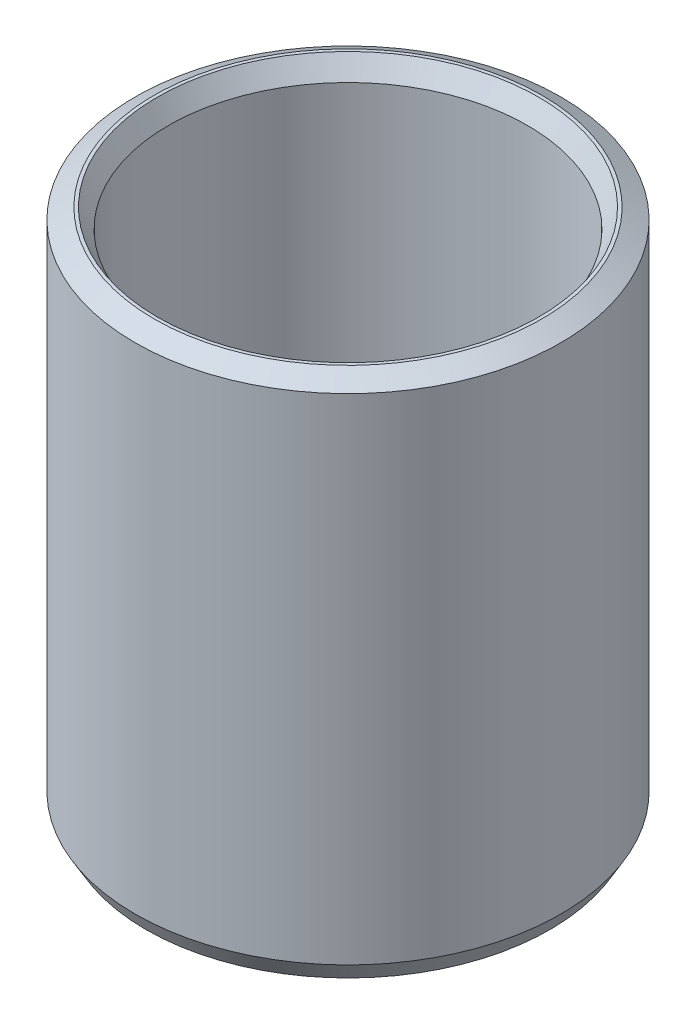
ISO-10303-21;
HEADER;
FILE_DESCRIPTION(('STEP AP214'),'2;1');
FILE_NAME('part.step','',(''),(''),'','','');
FILE_SCHEMA(('AUTOMOTIVE_DESIGN { 1 0 10303 214 1 1 1 1 }'));
ENDSEC;
DATA;
#1=APPLICATION_CONTEXT('core data for automotive mechanical design processes');
#2=APPLICATION_PROTOCOL_DEFINITION('international standard','automotive_design',2000,#1);
#3=PRODUCT_CONTEXT('',#1,'mechanical');
#4=PRODUCT('Part','Part','',(#3));
#5=PRODUCT_RELATED_PRODUCT_CATEGORY('part','',(#4));
#6=PRODUCT_DEFINITION_FORMATION('','',#4);
#7=PRODUCT_DEFINITION_CONTEXT('part definition',#1,'design');
#8=PRODUCT_DEFINITION('design','',#6,#7);
#9=PRODUCT_DEFINITION_SHAPE('','',#8);
#10=(LENGTH_UNIT() NAMED_UNIT(*) SI_UNIT(.MILLI.,.METRE.));
#11=(NAMED_UNIT(*) PLANE_ANGLE_UNIT() SI_UNIT($,.RADIAN.));
#12=(NAMED_UNIT(*) SI_UNIT($,.STERADIAN.) SOLID_ANGLE_UNIT());
#13=UNCERTAINTY_MEASURE_WITH_UNIT(LENGTH_MEASURE(1.E-05),#10,'distance_accuracy_value','');
#14=(GEOMETRIC_REPRESENTATION_CONTEXT(3) GLOBAL_UNCERTAINTY_ASSIGNED_CONTEXT((#13)) GLOBAL_UNIT_ASSIGNED_CONTEXT((#10,
#11,#12)) REPRESENTATION_CONTEXT('',''));
#15=CARTESIAN_POINT('',(0.,0.,0.));
#16=DIRECTION('',(0.,0.,1.));
#17=DIRECTION('',(1.,0.,0.));
#18=AXIS2_PLACEMENT_3D('',#15,#16,#17);
#19=CARTESIAN_POINT('',(0.,92.4407219834639,0.));
#20=DIRECTION('',(0.,-1.,0.));
#21=DIRECTION('',(0.,0.,-1.));
#22=AXIS2_PLACEMENT_3D('',#19,#20,#21);
#23=CYLINDRICAL_SURFACE('',#22,37.5);
#24=CARTESIAN_POINT('',(0.,3.36107461421821,0.));
#25=DIRECTION('',(0.,1.,0.));
#26=DIRECTION('',(0.,0.,1.));
#27=AXIS2_PLACEMENT_3D('',#24,#25,#26);
#28=CIRCLE('',#27,37.5);
#29=CARTESIAN_POINT('',(0.,3.36107461421821,37.5));
#30=VERTEX_POINT('',#29);
#31=EDGE_CURVE('E10',#30,#30,#28,.T.);
#32=ORIENTED_EDGE('',*,*,#31,.T.);
#33=EDGE_LOOP('',(#32));
#34=FACE_BOUND('',#33,.T.);
#35=CARTESIAN_POINT('',(0.,90.5002046501786,0.));
#36=DIRECTION('',(0.,1.,0.));
#37=DIRECTION('',(0.,0.,1.));
#38=AXIS2_PLACEMENT_3D('',#35,#36,#37);
#39=CIRCLE('',#38,37.5);
#40=CARTESIAN_POINT('',(0.,90.5002046501786,37.5));
#41=VERTEX_POINT('',#40);
#42=EDGE_CURVE('E50',#41,#41,#39,.F.);
#43=ORIENTED_EDGE('',*,*,#42,.T.);
#44=EDGE_LOOP('',(#43));
#45=FACE_BOUND('',#44,.T.);
#46=ADVANCED_FACE('F39',(#34,#45),#23,.T.);
#47=CARTESIAN_POINT('',(0.,92.4407219834639,0.));
#48=DIRECTION('',(0.,1.,0.));
#49=DIRECTION('',(0.,0.,1.));
#50=AXIS2_PLACEMENT_3D('',#47,#48,#49);
#51=PLANE('',#50);
#52=CARTESIAN_POINT('',(0.,92.4407219834639,0.));
#53=DIRECTION('',(0.,1.,0.));
#54=DIRECTION('',(0.,0.,1.));
#55=AXIS2_PLACEMENT_3D('',#52,#53,#54);
#56=CIRCLE('',#55,33.5708104720832);
#57=CARTESIAN_POINT('',(0.,92.4407219834639,33.5708104720832));
#58=VERTEX_POINT('',#57);
#59=EDGE_CURVE('E58',#58,#58,#56,.F.);
#60=ORIENTED_EDGE('',*,*,#59,.T.);
#61=EDGE_LOOP('',(#60));
#62=FACE_BOUND('',#61,.T.);
#63=CARTESIAN_POINT('',(0.,92.4407219834639,0.));
#64=DIRECTION('',(0.,1.,0.));
#65=DIRECTION('',(0.,0.,1.));
#66=AXIS2_PLACEMENT_3D('',#63,#64,#65);
#67=CIRCLE('',#66,34.1389253857818);
#68=CARTESIAN_POINT('',(0.,92.4407219834639,34.1389253857818));
#69=VERTEX_POINT('',#68);
#70=EDGE_CURVE('E61',#69,#69,#67,.T.);
#71=ORIENTED_EDGE('',*,*,#70,.T.);
#72=EDGE_LOOP('',(#71));
#73=FACE_BOUND('',#72,.T.);
#74=ADVANCED_FACE('F88',(#62,#73),#51,.T.);
#75=CARTESIAN_POINT('',(0.,0.,0.));
#76=DIRECTION('',(0.,1.,0.));
#77=DIRECTION('',(0.,0.,1.));
#78=AXIS2_PLACEMENT_3D('',#75,#76,#77);
#79=PLANE('',#78);
#80=CARTESIAN_POINT('',(0.,0.,0.));
#81=DIRECTION('',(0.,1.,0.));
#82=DIRECTION('',(0.,0.,1.));
#83=AXIS2_PLACEMENT_3D('',#80,#81,#82);
#84=CIRCLE('',#83,34.991367753016);
#85=CARTESIAN_POINT('',(0.,0.,34.991367753016));
#86=VERTEX_POINT('',#85);
#87=EDGE_CURVE('E51',#86,#86,#84,.T.);
#88=ORIENTED_EDGE('',*,*,#87,.T.);
#89=EDGE_LOOP('',(#88));
#90=FACE_BOUND('',#89,.T.);
#91=CARTESIAN_POINT('',(0.,0.,0.));
#92=DIRECTION('',(0.,1.,0.));
#93=DIRECTION('',(0.,0.,1.));
#94=AXIS2_PLACEMENT_3D('',#91,#92,#93);
#95=CIRCLE('',#94,35.5594826667147);
#96=CARTESIAN_POINT('',(0.,0.,35.5594826667147));
#97=VERTEX_POINT('',#96);
#98=EDGE_CURVE('E54',#97,#97,#95,.F.);
#99=ORIENTED_EDGE('',*,*,#98,.T.);
#100=EDGE_LOOP('',(#99));
#101=FACE_BOUND('',#100,.T.);
#102=ADVANCED_FACE('F83',(#90,#101),#79,.F.);
#103=CARTESIAN_POINT('',(0.,92.4407219834639,0.));
#104=DIRECTION('',(0.,-1.,0.));
#105=DIRECTION('',(0.,0.,-1.));
#106=AXIS2_PLACEMENT_3D('',#103,#104,#105);
#107=CYLINDRICAL_SURFACE('',#106,31.6302931387979);
#108=CARTESIAN_POINT('',(0.,89.0796473692458,0.));
#109=DIRECTION('',(0.,1.,0.));
#110=DIRECTION('',(0.,0.,1.));
#111=AXIS2_PLACEMENT_3D('',#108,#109,#110);
#112=CIRCLE('',#111,31.6302931387979);
#113=CARTESIAN_POINT('',(0.,89.0796473692458,31.6302931387979));
#114=VERTEX_POINT('',#113);
#115=EDGE_CURVE('E67',#114,#114,#112,.T.);
#116=ORIENTED_EDGE('',*,*,#115,.T.);
#117=EDGE_LOOP('',(#116));
#118=FACE_BOUND('',#117,.T.);
#119=CARTESIAN_POINT('',(0.,1.94051733328529,0.));
#120=DIRECTION('',(0.,1.,0.));
#121=DIRECTION('',(0.,0.,1.));
#122=AXIS2_PLACEMENT_3D('',#119,#120,#121);
#123=CIRCLE('',#122,31.6302931387979);
#124=CARTESIAN_POINT('',(0.,1.94051733328529,31.6302931387979));
#125=VERTEX_POINT('',#124);
#126=EDGE_CURVE('E69',#125,#125,#123,.F.);
#127=ORIENTED_EDGE('',*,*,#126,.T.);
#128=EDGE_LOOP('',(#127));
#129=FACE_BOUND('',#128,.T.);
#130=ADVANCED_FACE('F71',(#118,#129),#107,.F.);
#131=CARTESIAN_POINT('',(0.,89.0796473692458,0.));
#132=DIRECTION('',(0.,1.,0.));
#133=DIRECTION('',(0.,0.,1.));
#134=AXIS2_PLACEMENT_3D('',#131,#132,#133);
#135=CONICAL_SURFACE('',#134,31.6302931387979,0.5235987755983);
#136=CARTESIAN_POINT('',(0.,92.4407219834639,33.5708104720832));
#137=CARTESIAN_POINT('',(0.,92.4057107895658,33.5505967498615));
#138=CARTESIAN_POINT('',(0.,92.3706995956677,33.5303830276398));
#139=CARTESIAN_POINT('',(0.,92.3006772078715,33.4899555831963));
#140=CARTESIAN_POINT('',(0.,92.2656660139734,33.4697418609746));
#141=CARTESIAN_POINT('',(0.,92.1956436261772,33.4293144165311));
#142=CARTESIAN_POINT('',(0.,92.1606324322791,33.4091006943094));
#143=CARTESIAN_POINT('',(0.,92.0906100444829,33.368673249866));
#144=CARTESIAN_POINT('',(0.,92.0555988505848,33.3484595276443));
#145=CARTESIAN_POINT('',(0.,91.9855764627886,33.3080320832008));
#146=CARTESIAN_POINT('',(0.,91.9505652688904,33.2878183609791));
#147=CARTESIAN_POINT('',(0.,91.8805428810942,33.2473909165357));
#148=CARTESIAN_POINT('',(0.,91.8455316871961,33.2271771943139));
#149=CARTESIAN_POINT('',(0.,91.7755092993999,33.1867497498705));
#150=CARTESIAN_POINT('',(0.,91.7404981055018,33.1665360276488));
#151=CARTESIAN_POINT('',(0.,91.6704757177056,33.1261085832053));
#152=CARTESIAN_POINT('',(0.,91.6354645238075,33.1058948609836));
#153=CARTESIAN_POINT('',(0.,91.5654421360113,33.0654674165401));
#154=CARTESIAN_POINT('',(0.,91.5304309421132,33.0452536943184));
#155=CARTESIAN_POINT('',(0.,91.460408554317,33.004826249875));
#156=CARTESIAN_POINT('',(0.,91.4253973604189,32.9846125276533));
#157=CARTESIAN_POINT('',(0.,91.3553749726226,32.9441850832098));
#158=CARTESIAN_POINT('',(0.,91.3203637787245,32.9239713609881));
#159=CARTESIAN_POINT('',(0.,91.2503413909283,32.8835439165447));
#160=CARTESIAN_POINT('',(0.,91.2153301970302,32.8633301943229));
#161=CARTESIAN_POINT('',(0.,91.145307809234,32.8229027498795));
#162=CARTESIAN_POINT('',(0.,91.1102966153359,32.8026890276578));
#163=CARTESIAN_POINT('',(0.,91.0402742275397,32.7622615832143));
#164=CARTESIAN_POINT('',(0.,91.0052630336416,32.7420478609926));
#165=CARTESIAN_POINT('',(0.,90.9352406458454,32.7016204165492));
#166=CARTESIAN_POINT('',(0.,90.9002294519473,32.6814066943274));
#167=CARTESIAN_POINT('',(0.,90.8302070641511,32.640979249884));
#168=CARTESIAN_POINT('',(0.,90.795195870253,32.6207655276623));
#169=CARTESIAN_POINT('',(0.,90.7251734824567,32.5803380832188));
#170=CARTESIAN_POINT('',(0.,90.6901622885586,32.5601243609971));
#171=CARTESIAN_POINT('',(0.,90.6201399007624,32.5196969165537));
#172=CARTESIAN_POINT('',(0.,90.5851287068643,32.4994831943319));
#173=CARTESIAN_POINT('',(0.,90.5151063190681,32.4590557498885));
#174=CARTESIAN_POINT('',(0.,90.48009512517,32.4388420276668));
#175=CARTESIAN_POINT('',(0.,90.4100727373738,32.3984145832233));
#176=CARTESIAN_POINT('',(0.,90.3750615434757,32.3782008610016));
#177=CARTESIAN_POINT('',(0.,90.3050391556795,32.3377734165582));
#178=CARTESIAN_POINT('',(0.,90.2700279617814,32.3175596943364));
#179=CARTESIAN_POINT('',(0.,90.2000055739851,32.277132249893));
#180=CARTESIAN_POINT('',(0.,90.164994380087,32.2569185276713));
#181=CARTESIAN_POINT('',(0.,90.0949719922908,32.2164910832278));
#182=CARTESIAN_POINT('',(0.,90.0599607983927,32.1962773610061));
#183=CARTESIAN_POINT('',(0.,89.9899384105965,32.1558499165627));
#184=CARTESIAN_POINT('',(0.,89.9549272166984,32.1356361943409));
#185=CARTESIAN_POINT('',(0.,89.8849048289022,32.0952087498975));
#186=CARTESIAN_POINT('',(0.,89.8498936350041,32.0749950276758));
#187=CARTESIAN_POINT('',(0.,89.7798712472079,32.0345675832323));
#188=CARTESIAN_POINT('',(0.,89.7448600533098,32.0143538610106));
#189=CARTESIAN_POINT('',(0.,89.6748376655136,31.9739264165672));
#190=CARTESIAN_POINT('',(0.,89.6398264716155,31.9537126943455));
#191=CARTESIAN_POINT('',(0.,89.5698040838192,31.913285249902));
#192=CARTESIAN_POINT('',(0.,89.5347928899211,31.8930715276803));
#193=CARTESIAN_POINT('',(0.,89.4647705021249,31.8526440832368));
#194=CARTESIAN_POINT('',(0.,89.4297593082268,31.8324303610151));
#195=CARTESIAN_POINT('',(0.,89.3597369204306,31.7920029165717));
#196=CARTESIAN_POINT('',(0.,89.3247257265325,31.77178919435));
#197=CARTESIAN_POINT('',(0.,89.2547033387363,31.7313617499065));
#198=CARTESIAN_POINT('',(0.,89.2196921448382,31.7111480276848));
#199=CARTESIAN_POINT('',(0.,89.149669757042,31.6707205832413));
#200=CARTESIAN_POINT('',(0.,89.1146585631439,31.6505068610196));
#201=CARTESIAN_POINT('',(0.,89.0796473692458,31.6302931387979));
#202=B_SPLINE_CURVE_WITH_KNOTS('',3,(#136,#137,#138,#139,#140,#141,#142,#143,#144,#145,#146,
#147,#148,#149,#150,#151,#152,#153,#154,#155,#156,#157,#158,#159,#160,#161,#162,#163,#164,#165,
#166,#167,#168,#169,#170,#171,#172,#173,#174,#175,#176,#177,#178,#179,#180,#181,#182,#183,#184,
#185,#186,#187,#188,#189,#190,#191,#192,#193,#194,#195,#196,#197,#198,#199,#200,#201),
.UNSPECIFIED.,.F.,.F.,(4,2,2,2,2,2,2,2,2,2,2,2,2,2,2,2,2,2,2,2,2,2,2,2,2,2,2,2,2,2,2,2,4),(0.,
0.121282333330335,0.24256466666067,0.363846999991002,0.485129333321325,0.60641166665166,
0.727693999981991,0.848976333312326,0.97025866664265,1.09154099997298,1.21282333330332,
1.33410566663364,1.45538799996397,1.57667033329431,1.69795266662464,1.81923499995496,
1.9405173332853,2.06179966661563,2.18308199994595,2.30436433327628,2.42564666660662,
2.54692899993695,2.66821133326727,2.78949366659761,2.91077599992794,3.03205833325826,
3.1533406665886,3.27462299991893,3.39590533324926,3.51718766657959,3.63846999990992,
3.75975233324025,3.88103466657057),.UNSPECIFIED.);
#203=EDGE_CURVE('BSEAM77',#58,#114,#202,.T.);
#204=ORIENTED_EDGE('',*,*,#59,.F.);
#205=ORIENTED_EDGE('',*,*,#115,.F.);
#206=ORIENTED_EDGE('',*,*,#203,.T.);
#207=ORIENTED_EDGE('',*,*,#203,.F.);
#208=EDGE_LOOP('',(#204,#206,#205,#207));
#209=FACE_BOUND('',#208,.T.);
#210=ADVANCED_FACE('F77',(#209),#135,.F.);
#211=CARTESIAN_POINT('',(0.,0.,0.));
#212=DIRECTION('',(0.,-1.,0.));
#213=DIRECTION('',(0.,0.,-1.));
#214=AXIS2_PLACEMENT_3D('',#211,#212,#213);
#215=CONICAL_SURFACE('',#214,34.991367753016,1.04719755119659);
#216=ORIENTED_EDGE('',*,*,#126,.F.);
#217=EDGE_LOOP('',(#216));
#218=FACE_BOUND('',#217,.T.);
#219=ORIENTED_EDGE('',*,*,#87,.F.);
#220=EDGE_LOOP('',(#219));
#221=FACE_BOUND('',#220,.T.);
#222=ADVANCED_FACE('F73',(#218,#221),#215,.F.);
#223=CARTESIAN_POINT('',(0.,3.36107461421821,0.));
#224=DIRECTION('',(0.,1.,0.));
#225=DIRECTION('',(0.,0.,1.));
#226=AXIS2_PLACEMENT_3D('',#223,#224,#225);
#227=CONICAL_SURFACE('',#226,37.5,0.523598775598301);
#228=ORIENTED_EDGE('',*,*,#98,.F.);
#229=EDGE_LOOP('',(#228));
#230=FACE_BOUND('',#229,.T.);
#231=ORIENTED_EDGE('',*,*,#31,.F.);
#232=EDGE_LOOP('',(#231));
#233=FACE_BOUND('',#232,.T.);
#234=ADVANCED_FACE('F76',(#230,#233),#227,.T.);
#235=CARTESIAN_POINT('',(0.,92.4407219834639,0.));
#236=DIRECTION('',(0.,-1.,0.));
#237=DIRECTION('',(0.,0.,-1.));
#238=AXIS2_PLACEMENT_3D('',#235,#236,#237);
#239=CONICAL_SURFACE('',#238,34.1389253857818,1.04719755119659);
#240=ORIENTED_EDGE('',*,*,#42,.F.);
#241=EDGE_LOOP('',(#240));
#242=FACE_BOUND('',#241,.T.);
#243=ORIENTED_EDGE('',*,*,#70,.F.);
#244=EDGE_LOOP('',(#243));
#245=FACE_BOUND('',#244,.T.);
#246=ADVANCED_FACE('F45',(#242,#245),#239,.T.);
#247=CLOSED_SHELL('',(#46,#74,#102,#130,#210,#222,#234,#246));
#248=MANIFOLD_SOLID_BREP('B2',#247);
#249=ADVANCED_BREP_SHAPE_REPRESENTATION('',(#18,#248),#14);
#250=SHAPE_DEFINITION_REPRESENTATION(#9,#249);
ENDSEC;
END-ISO-10303-21;
